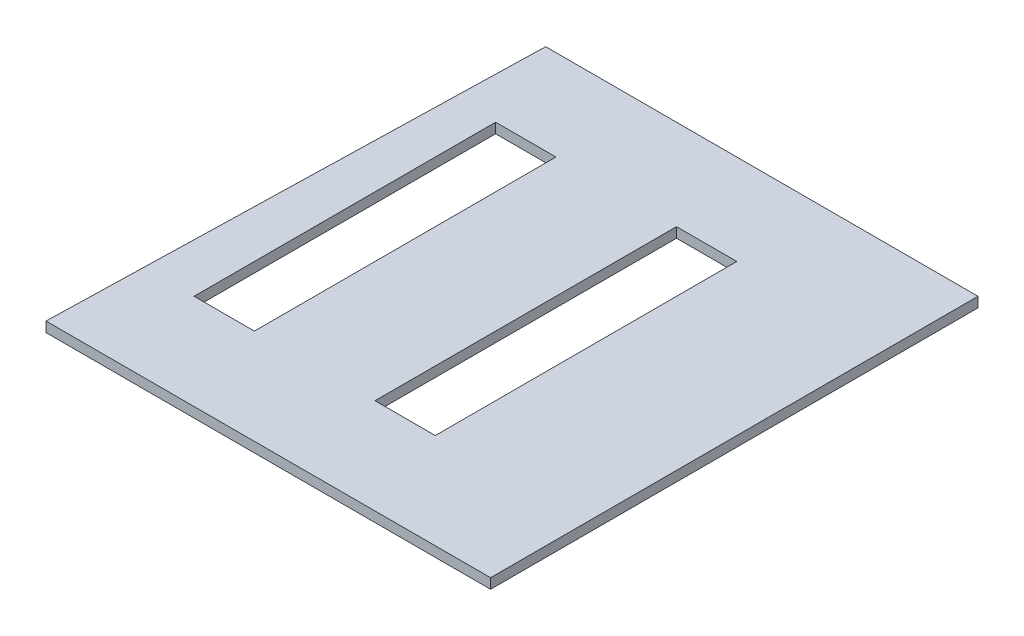
ISO-10303-21;
HEADER;
FILE_DESCRIPTION(('STEP AP214'),'2;1');
FILE_NAME('part.step','',(''),(''),'','','');
FILE_SCHEMA(('AUTOMOTIVE_DESIGN { 1 0 10303 214 1 1 1 1 }'));
ENDSEC;
DATA;
#1=APPLICATION_CONTEXT('core data for automotive mechanical design processes');
#2=APPLICATION_PROTOCOL_DEFINITION('international standard','automotive_design',2000,#1);
#3=PRODUCT_CONTEXT('',#1,'mechanical');
#4=PRODUCT('Part','Part','',(#3));
#5=PRODUCT_RELATED_PRODUCT_CATEGORY('part','',(#4));
#6=PRODUCT_DEFINITION_FORMATION('','',#4);
#7=PRODUCT_DEFINITION_CONTEXT('part definition',#1,'design');
#8=PRODUCT_DEFINITION('design','',#6,#7);
#9=PRODUCT_DEFINITION_SHAPE('','',#8);
#10=(LENGTH_UNIT() NAMED_UNIT(*) SI_UNIT(.MILLI.,.METRE.));
#11=(NAMED_UNIT(*) PLANE_ANGLE_UNIT() SI_UNIT($,.RADIAN.));
#12=(NAMED_UNIT(*) SI_UNIT($,.STERADIAN.) SOLID_ANGLE_UNIT());
#13=UNCERTAINTY_MEASURE_WITH_UNIT(LENGTH_MEASURE(1.E-05),#10,'distance_accuracy_value','');
#14=(GEOMETRIC_REPRESENTATION_CONTEXT(3) GLOBAL_UNCERTAINTY_ASSIGNED_CONTEXT((#13)) GLOBAL_UNIT_ASSIGNED_CONTEXT((#10,
#11,#12)) REPRESENTATION_CONTEXT('',''));
#15=CARTESIAN_POINT('',(0.,0.,0.));
#16=DIRECTION('',(0.,0.,1.));
#17=DIRECTION('',(1.,0.,0.));
#18=AXIS2_PLACEMENT_3D('',#15,#16,#17);
#19=CARTESIAN_POINT('',(1123.42457669165,50.8,-1231.7416518491));
#20=DIRECTION('',(-1.,0.,0.));
#21=DIRECTION('',(0.,0.,1.));
#22=AXIS2_PLACEMENT_3D('',#19,#20,#21);
#23=PLANE('',#22);
#24=DIRECTION('',(0.,0.,-1.));
#25=VECTOR('',#24,1.);
#26=CARTESIAN_POINT('',(1123.42457669165,0.,-1231.7416518491));
#27=LINE('',#26,#25);
#28=CARTESIAN_POINT('',(1123.42457669165,0.,1232.0583481509));
#29=VERTEX_POINT('',#28);
#30=CARTESIAN_POINT('',(1123.42457669165,0.,-1231.7416518491));
#31=VERTEX_POINT('',#30);
#32=EDGE_CURVE('E163',#29,#31,#27,.T.);
#33=ORIENTED_EDGE('',*,*,#32,.T.);
#34=DIRECTION('',(0.,-1.,0.));
#35=VECTOR('',#34,1.);
#36=CARTESIAN_POINT('',(1123.42457669165,50.8,-1231.7416518491));
#37=LINE('',#36,#35);
#38=CARTESIAN_POINT('',(1123.42457669165,50.8,-1231.7416518491));
#39=VERTEX_POINT('',#38);
#40=EDGE_CURVE('E11',#39,#31,#37,.T.);
#41=ORIENTED_EDGE('',*,*,#40,.F.);
#42=DIRECTION('',(0.,0.,-1.));
#43=VECTOR('',#42,1.);
#44=CARTESIAN_POINT('',(1123.42457669165,50.8,-1231.7416518491));
#45=LINE('',#44,#43);
#46=CARTESIAN_POINT('',(1123.42457669165,50.8,1232.0583481509));
#47=VERTEX_POINT('',#46);
#48=EDGE_CURVE('E192',#47,#39,#45,.T.);
#49=ORIENTED_EDGE('',*,*,#48,.F.);
#50=DIRECTION('',(0.,-1.,0.));
#51=VECTOR('',#50,1.);
#52=CARTESIAN_POINT('',(1123.42457669165,50.8,1232.0583481509));
#53=LINE('',#52,#51);
#54=EDGE_CURVE('E202',#47,#29,#53,.T.);
#55=ORIENTED_EDGE('',*,*,#54,.T.);
#56=EDGE_LOOP('',(#33,#41,#49,#55));
#57=FACE_BOUND('',#56,.T.);
#58=ADVANCED_FACE('F40',(#57),#23,.F.);
#59=CARTESIAN_POINT('',(-1061.73742330835,50.8,-1231.7416518491));
#60=DIRECTION('',(0.,0.,1.));
#61=DIRECTION('',(1.,0.,0.));
#62=AXIS2_PLACEMENT_3D('',#59,#60,#61);
#63=PLANE('',#62);
#64=DIRECTION('',(-1.,0.,0.));
#65=VECTOR('',#64,1.);
#66=CARTESIAN_POINT('',(-1061.73742330835,0.,-1231.7416518491));
#67=LINE('',#66,#65);
#68=CARTESIAN_POINT('',(-1061.73742330835,0.,-1231.7416518491));
#69=VERTEX_POINT('',#68);
#70=EDGE_CURVE('E205',#31,#69,#67,.T.);
#71=ORIENTED_EDGE('',*,*,#70,.T.);
#72=DIRECTION('',(0.,-1.,0.));
#73=VECTOR('',#72,1.);
#74=CARTESIAN_POINT('',(-1061.73742330835,50.8,-1231.7416518491));
#75=LINE('',#74,#73);
#76=CARTESIAN_POINT('',(-1061.73742330835,50.8,-1231.7416518491));
#77=VERTEX_POINT('',#76);
#78=EDGE_CURVE('E47',#77,#69,#75,.T.);
#79=ORIENTED_EDGE('',*,*,#78,.F.);
#80=DIRECTION('',(-1.,0.,0.));
#81=VECTOR('',#80,1.);
#82=CARTESIAN_POINT('',(-1061.73742330835,50.8,-1231.7416518491));
#83=LINE('',#82,#81);
#84=EDGE_CURVE('E195',#39,#77,#83,.T.);
#85=ORIENTED_EDGE('',*,*,#84,.F.);
#86=ORIENTED_EDGE('',*,*,#40,.T.);
#87=EDGE_LOOP('',(#71,#79,#85,#86));
#88=FACE_BOUND('',#87,.T.);
#89=ADVANCED_FACE('F234',(#88),#63,.F.);
#90=CARTESIAN_POINT('',(-1123.71342330835,50.8,1232.0583481509));
#91=DIRECTION('',(0.999683772127353,0.,0.0251466845772241));
#92=DIRECTION('',(0.0251466845772241,0.,-0.999683772127353));
#93=AXIS2_PLACEMENT_3D('',#90,#91,#92);
#94=PLANE('',#93);
#95=DIRECTION('',(-0.0251466845772241,0.,0.999683772127353));
#96=VECTOR('',#95,1.);
#97=CARTESIAN_POINT('',(-1123.71342330835,0.,1232.0583481509));
#98=LINE('',#97,#96);
#99=CARTESIAN_POINT('',(-1123.71342330835,0.,1232.0583481509));
#100=VERTEX_POINT('',#99);
#101=EDGE_CURVE('E207',#69,#100,#98,.T.);
#102=ORIENTED_EDGE('',*,*,#101,.T.);
#103=DIRECTION('',(0.,-1.,0.));
#104=VECTOR('',#103,1.);
#105=CARTESIAN_POINT('',(-1123.71342330835,50.8,1232.0583481509));
#106=LINE('',#105,#104);
#107=CARTESIAN_POINT('',(-1123.71342330835,50.8,1232.0583481509));
#108=VERTEX_POINT('',#107);
#109=EDGE_CURVE('E212',#108,#100,#106,.T.);
#110=ORIENTED_EDGE('',*,*,#109,.F.);
#111=DIRECTION('',(-0.0251466845772241,0.,0.999683772127353));
#112=VECTOR('',#111,1.);
#113=CARTESIAN_POINT('',(-1123.71342330835,50.8,1232.0583481509));
#114=LINE('',#113,#112);
#115=EDGE_CURVE('E198',#77,#108,#114,.T.);
#116=ORIENTED_EDGE('',*,*,#115,.F.);
#117=ORIENTED_EDGE('',*,*,#78,.T.);
#118=EDGE_LOOP('',(#102,#110,#116,#117));
#119=FACE_BOUND('',#118,.T.);
#120=ADVANCED_FACE('F219',(#119),#94,.F.);
#121=CARTESIAN_POINT('',(-1123.71342330835,50.8,1232.0583481509));
#122=DIRECTION('',(0.,0.,-1.));
#123=DIRECTION('',(-1.,0.,0.));
#124=AXIS2_PLACEMENT_3D('',#121,#122,#123);
#125=PLANE('',#124);
#126=DIRECTION('',(1.,0.,0.));
#127=VECTOR('',#126,1.);
#128=CARTESIAN_POINT('',(-1123.71342330835,0.,1232.0583481509));
#129=LINE('',#128,#127);
#130=EDGE_CURVE('E196',#100,#29,#129,.T.);
#131=ORIENTED_EDGE('',*,*,#130,.T.);
#132=ORIENTED_EDGE('',*,*,#54,.F.);
#133=DIRECTION('',(1.,0.,0.));
#134=VECTOR('',#133,1.);
#135=CARTESIAN_POINT('',(-1123.71342330835,50.8,1232.0583481509));
#136=LINE('',#135,#134);
#137=EDGE_CURVE('E200',#108,#47,#136,.T.);
#138=ORIENTED_EDGE('',*,*,#137,.F.);
#139=ORIENTED_EDGE('',*,*,#109,.T.);
#140=EDGE_LOOP('',(#131,#132,#138,#139));
#141=FACE_BOUND('',#140,.T.);
#142=ADVANCED_FACE('F228',(#141),#125,.F.);
#143=CARTESIAN_POINT('',(0.,50.8,0.));
#144=DIRECTION('',(0.,1.,0.));
#145=DIRECTION('',(0.,0.,1.));
#146=AXIS2_PLACEMENT_3D('',#143,#144,#145);
#147=PLANE('',#146);
#148=DIRECTION('',(0.,0.,-1.));
#149=VECTOR('',#148,1.);
#150=CARTESIAN_POINT('',(361.424576691651,50.8,749.458348150897));
#151=LINE('',#150,#149);
#152=CARTESIAN_POINT('',(361.424576691651,50.8,749.458348150897));
#153=VERTEX_POINT('',#152);
#154=CARTESIAN_POINT('',(361.424576691651,50.8,-774.541651849103));
#155=VERTEX_POINT('',#154);
#156=EDGE_CURVE('E54',#153,#155,#151,.T.);
#157=ORIENTED_EDGE('',*,*,#156,.F.);
#158=DIRECTION('',(1.,0.,0.));
#159=VECTOR('',#158,1.);
#160=CARTESIAN_POINT('',(56.6245766916513,50.8,749.458348150897));
#161=LINE('',#160,#159);
#162=CARTESIAN_POINT('',(56.6245766916513,50.8,749.458348150897));
#163=VERTEX_POINT('',#162);
#164=EDGE_CURVE('E152',#163,#153,#161,.T.);
#165=ORIENTED_EDGE('',*,*,#164,.F.);
#166=DIRECTION('',(0.,0.,1.));
#167=VECTOR('',#166,1.);
#168=CARTESIAN_POINT('',(56.6245766916513,50.8,749.458348150897));
#169=LINE('',#168,#167);
#170=CARTESIAN_POINT('',(56.6245766916513,50.8,-774.541651849103));
#171=VERTEX_POINT('',#170);
#172=EDGE_CURVE('E135',#171,#163,#169,.T.);
#173=ORIENTED_EDGE('',*,*,#172,.F.);
#174=DIRECTION('',(-1.,0.,0.));
#175=VECTOR('',#174,1.);
#176=CARTESIAN_POINT('',(56.6245766916513,50.8,-774.541651849103));
#177=LINE('',#176,#175);
#178=EDGE_CURVE('E145',#155,#171,#177,.T.);
#179=ORIENTED_EDGE('',*,*,#178,.F.);
#180=EDGE_LOOP('',(#157,#165,#173,#179));
#181=FACE_BOUND('',#180,.T.);
#182=DIRECTION('',(0.,0.,-1.));
#183=VECTOR('',#182,1.);
#184=CARTESIAN_POINT('',(-552.975423308349,50.8,749.458348150897));
#185=LINE('',#184,#183);
#186=CARTESIAN_POINT('',(-552.975423308349,50.8,749.458348150897));
#187=VERTEX_POINT('',#186);
#188=CARTESIAN_POINT('',(-552.975423308349,50.8,-774.541651849103));
#189=VERTEX_POINT('',#188);
#190=EDGE_CURVE('E62',#187,#189,#185,.T.);
#191=ORIENTED_EDGE('',*,*,#190,.F.);
#192=DIRECTION('',(1.,0.,0.));
#193=VECTOR('',#192,1.);
#194=CARTESIAN_POINT('',(-857.775423308349,50.8,749.458348150897));
#195=LINE('',#194,#193);
#196=CARTESIAN_POINT('',(-857.775423308349,50.8,749.458348150897));
#197=VERTEX_POINT('',#196);
#198=EDGE_CURVE('E181',#197,#187,#195,.T.);
#199=ORIENTED_EDGE('',*,*,#198,.F.);
#200=DIRECTION('',(0.,0.,1.));
#201=VECTOR('',#200,1.);
#202=CARTESIAN_POINT('',(-857.775423308349,50.8,749.458348150897));
#203=LINE('',#202,#201);
#204=CARTESIAN_POINT('',(-857.775423308349,50.8,-774.541651849103));
#205=VERTEX_POINT('',#204);
#206=EDGE_CURVE('E178',#205,#197,#203,.T.);
#207=ORIENTED_EDGE('',*,*,#206,.F.);
#208=DIRECTION('',(-1.,0.,0.));
#209=VECTOR('',#208,1.);
#210=CARTESIAN_POINT('',(-857.775423308349,50.8,-774.541651849103));
#211=LINE('',#210,#209);
#212=EDGE_CURVE('E175',#189,#205,#211,.T.);
#213=ORIENTED_EDGE('',*,*,#212,.F.);
#214=EDGE_LOOP('',(#191,#199,#207,#213));
#215=FACE_BOUND('',#214,.T.);
#216=ORIENTED_EDGE('',*,*,#48,.T.);
#217=ORIENTED_EDGE('',*,*,#84,.T.);
#218=ORIENTED_EDGE('',*,*,#115,.T.);
#219=ORIENTED_EDGE('',*,*,#137,.T.);
#220=EDGE_LOOP('',(#216,#217,#218,#219));
#221=FACE_BOUND('',#220,.T.);
#222=ADVANCED_FACE('F149',(#181,#215,#221),#147,.T.);
#223=CARTESIAN_POINT('',(0.,0.,0.));
#224=DIRECTION('',(0.,1.,0.));
#225=DIRECTION('',(0.,0.,1.));
#226=AXIS2_PLACEMENT_3D('',#223,#224,#225);
#227=PLANE('',#226);
#228=DIRECTION('',(-1.,0.,0.));
#229=VECTOR('',#228,1.);
#230=CARTESIAN_POINT('',(56.6245766916513,0.,749.458348150897));
#231=LINE('',#230,#229);
#232=CARTESIAN_POINT('',(361.424576691651,0.,749.458348150897));
#233=VERTEX_POINT('',#232);
#234=CARTESIAN_POINT('',(56.6245766916513,0.,749.458348150897));
#235=VERTEX_POINT('',#234);
#236=EDGE_CURVE('E278',#233,#235,#231,.T.);
#237=ORIENTED_EDGE('',*,*,#236,.F.);
#238=DIRECTION('',(0.,0.,1.));
#239=VECTOR('',#238,1.);
#240=CARTESIAN_POINT('',(361.424576691651,0.,749.458348150897));
#241=LINE('',#240,#239);
#242=CARTESIAN_POINT('',(361.424576691651,0.,-774.541651849103));
#243=VERTEX_POINT('',#242);
#244=EDGE_CURVE('E164',#243,#233,#241,.T.);
#245=ORIENTED_EDGE('',*,*,#244,.F.);
#246=DIRECTION('',(1.,0.,0.));
#247=VECTOR('',#246,1.);
#248=CARTESIAN_POINT('',(56.6245766916513,0.,-774.541651849103));
#249=LINE('',#248,#247);
#250=CARTESIAN_POINT('',(56.6245766916513,0.,-774.541651849103));
#251=VERTEX_POINT('',#250);
#252=EDGE_CURVE('E161',#251,#243,#249,.T.);
#253=ORIENTED_EDGE('',*,*,#252,.F.);
#254=DIRECTION('',(0.,0.,-1.));
#255=VECTOR('',#254,1.);
#256=CARTESIAN_POINT('',(56.6245766916513,0.,749.458348150897));
#257=LINE('',#256,#255);
#258=EDGE_CURVE('E138',#235,#251,#257,.T.);
#259=ORIENTED_EDGE('',*,*,#258,.F.);
#260=EDGE_LOOP('',(#237,#245,#253,#259));
#261=FACE_BOUND('',#260,.T.);
#262=DIRECTION('',(-1.,0.,0.));
#263=VECTOR('',#262,1.);
#264=CARTESIAN_POINT('',(-857.775423308349,0.,749.458348150897));
#265=LINE('',#264,#263);
#266=CARTESIAN_POINT('',(-552.975423308349,0.,749.458348150897));
#267=VERTEX_POINT('',#266);
#268=CARTESIAN_POINT('',(-857.775423308349,0.,749.458348150897));
#269=VERTEX_POINT('',#268);
#270=EDGE_CURVE('E168',#267,#269,#265,.T.);
#271=ORIENTED_EDGE('',*,*,#270,.F.);
#272=DIRECTION('',(0.,0.,1.));
#273=VECTOR('',#272,1.);
#274=CARTESIAN_POINT('',(-552.975423308349,0.,749.458348150897));
#275=LINE('',#274,#273);
#276=CARTESIAN_POINT('',(-552.975423308349,0.,-774.541651849103));
#277=VERTEX_POINT('',#276);
#278=EDGE_CURVE('E171',#277,#267,#275,.T.);
#279=ORIENTED_EDGE('',*,*,#278,.F.);
#280=DIRECTION('',(1.,0.,0.));
#281=VECTOR('',#280,1.);
#282=CARTESIAN_POINT('',(-857.775423308349,0.,-774.541651849103));
#283=LINE('',#282,#281);
#284=CARTESIAN_POINT('',(-857.775423308349,0.,-774.541651849103));
#285=VERTEX_POINT('',#284);
#286=EDGE_CURVE('E173',#285,#277,#283,.T.);
#287=ORIENTED_EDGE('',*,*,#286,.F.);
#288=DIRECTION('',(0.,0.,-1.));
#289=VECTOR('',#288,1.);
#290=CARTESIAN_POINT('',(-857.775423308349,0.,749.458348150897));
#291=LINE('',#290,#289);
#292=EDGE_CURVE('E165',#269,#285,#291,.T.);
#293=ORIENTED_EDGE('',*,*,#292,.F.);
#294=EDGE_LOOP('',(#271,#279,#287,#293));
#295=FACE_BOUND('',#294,.T.);
#296=ORIENTED_EDGE('',*,*,#32,.F.);
#297=ORIENTED_EDGE('',*,*,#130,.F.);
#298=ORIENTED_EDGE('',*,*,#101,.F.);
#299=ORIENTED_EDGE('',*,*,#70,.F.);
#300=EDGE_LOOP('',(#296,#297,#298,#299));
#301=FACE_BOUND('',#300,.T.);
#302=ADVANCED_FACE('F225',(#261,#295,#301),#227,.F.);
#303=CARTESIAN_POINT('',(-552.975423308349,-1554.18114774308,749.458348150897));
#304=DIRECTION('',(1.,0.,0.));
#305=DIRECTION('',(0.,0.,-1.));
#306=AXIS2_PLACEMENT_3D('',#303,#304,#305);
#307=PLANE('',#306);
#308=ORIENTED_EDGE('',*,*,#278,.T.);
#309=DIRECTION('',(0.,1.,0.));
#310=VECTOR('',#309,1.);
#311=CARTESIAN_POINT('',(-552.975423308349,-1554.18114774308,749.458348150897));
#312=LINE('',#311,#310);
#313=EDGE_CURVE('E169',#267,#187,#312,.T.);
#314=ORIENTED_EDGE('',*,*,#313,.T.);
#315=ORIENTED_EDGE('',*,*,#190,.T.);
#316=DIRECTION('',(0.,1.,0.));
#317=VECTOR('',#316,1.);
#318=CARTESIAN_POINT('',(-552.975423308349,-1554.18114774308,-774.541651849103));
#319=LINE('',#318,#317);
#320=EDGE_CURVE('E184',#277,#189,#319,.T.);
#321=ORIENTED_EDGE('',*,*,#320,.F.);
#322=EDGE_LOOP('',(#308,#314,#315,#321));
#323=FACE_BOUND('',#322,.T.);
#324=ADVANCED_FACE('F246',(#323),#307,.F.);
#325=CARTESIAN_POINT('',(-857.775423308349,-1554.18114774308,749.458348150897));
#326=DIRECTION('',(0.,0.,1.));
#327=DIRECTION('',(1.,0.,0.));
#328=AXIS2_PLACEMENT_3D('',#325,#326,#327);
#329=PLANE('',#328);
#330=ORIENTED_EDGE('',*,*,#270,.T.);
#331=DIRECTION('',(0.,1.,0.));
#332=VECTOR('',#331,1.);
#333=CARTESIAN_POINT('',(-857.775423308349,-1554.18114774308,749.458348150897));
#334=LINE('',#333,#332);
#335=EDGE_CURVE('E186',#269,#197,#334,.T.);
#336=ORIENTED_EDGE('',*,*,#335,.T.);
#337=ORIENTED_EDGE('',*,*,#198,.T.);
#338=ORIENTED_EDGE('',*,*,#313,.F.);
#339=EDGE_LOOP('',(#330,#336,#337,#338));
#340=FACE_BOUND('',#339,.T.);
#341=ADVANCED_FACE('F252',(#340),#329,.F.);
#342=CARTESIAN_POINT('',(-857.775423308349,-1554.18114774308,749.458348150897));
#343=DIRECTION('',(-1.,0.,0.));
#344=DIRECTION('',(0.,0.,1.));
#345=AXIS2_PLACEMENT_3D('',#342,#343,#344);
#346=PLANE('',#345);
#347=ORIENTED_EDGE('',*,*,#292,.T.);
#348=DIRECTION('',(0.,1.,0.));
#349=VECTOR('',#348,1.);
#350=CARTESIAN_POINT('',(-857.775423308349,-1554.18114774308,-774.541651849103));
#351=LINE('',#350,#349);
#352=EDGE_CURVE('E188',#285,#205,#351,.T.);
#353=ORIENTED_EDGE('',*,*,#352,.T.);
#354=ORIENTED_EDGE('',*,*,#206,.T.);
#355=ORIENTED_EDGE('',*,*,#335,.F.);
#356=EDGE_LOOP('',(#347,#353,#354,#355));
#357=FACE_BOUND('',#356,.T.);
#358=ADVANCED_FACE('F257',(#357),#346,.F.);
#359=CARTESIAN_POINT('',(-857.775423308349,-1554.18114774308,-774.541651849103));
#360=DIRECTION('',(0.,0.,-1.));
#361=DIRECTION('',(-1.,0.,0.));
#362=AXIS2_PLACEMENT_3D('',#359,#360,#361);
#363=PLANE('',#362);
#364=ORIENTED_EDGE('',*,*,#286,.T.);
#365=ORIENTED_EDGE('',*,*,#320,.T.);
#366=ORIENTED_EDGE('',*,*,#212,.T.);
#367=ORIENTED_EDGE('',*,*,#352,.F.);
#368=EDGE_LOOP('',(#364,#365,#366,#367));
#369=FACE_BOUND('',#368,.T.);
#370=ADVANCED_FACE('F253',(#369),#363,.F.);
#371=CARTESIAN_POINT('',(361.424576691651,-1554.18114774308,749.458348150897));
#372=DIRECTION('',(1.,0.,0.));
#373=DIRECTION('',(0.,0.,-1.));
#374=AXIS2_PLACEMENT_3D('',#371,#372,#373);
#375=PLANE('',#374);
#376=ORIENTED_EDGE('',*,*,#244,.T.);
#377=DIRECTION('',(0.,1.,0.));
#378=VECTOR('',#377,1.);
#379=CARTESIAN_POINT('',(361.424576691651,-1554.18114774308,749.458348150897));
#380=LINE('',#379,#378);
#381=EDGE_CURVE('E157',#233,#153,#380,.T.);
#382=ORIENTED_EDGE('',*,*,#381,.T.);
#383=ORIENTED_EDGE('',*,*,#156,.T.);
#384=DIRECTION('',(0.,1.,0.));
#385=VECTOR('',#384,1.);
#386=CARTESIAN_POINT('',(361.424576691651,-1554.18114774308,-774.541651849103));
#387=LINE('',#386,#385);
#388=EDGE_CURVE('E142',#243,#155,#387,.T.);
#389=ORIENTED_EDGE('',*,*,#388,.F.);
#390=EDGE_LOOP('',(#376,#382,#383,#389));
#391=FACE_BOUND('',#390,.T.);
#392=ADVANCED_FACE('F256',(#391),#375,.F.);
#393=CARTESIAN_POINT('',(56.6245766916513,-1554.18114774308,749.458348150897));
#394=DIRECTION('',(0.,0.,1.));
#395=DIRECTION('',(1.,0.,0.));
#396=AXIS2_PLACEMENT_3D('',#393,#394,#395);
#397=PLANE('',#396);
#398=ORIENTED_EDGE('',*,*,#236,.T.);
#399=DIRECTION('',(0.,1.,0.));
#400=VECTOR('',#399,1.);
#401=CARTESIAN_POINT('',(56.6245766916513,-1554.18114774308,749.458348150897));
#402=LINE('',#401,#400);
#403=EDGE_CURVE('E141',#235,#163,#402,.T.);
#404=ORIENTED_EDGE('',*,*,#403,.T.);
#405=ORIENTED_EDGE('',*,*,#164,.T.);
#406=ORIENTED_EDGE('',*,*,#381,.F.);
#407=EDGE_LOOP('',(#398,#404,#405,#406));
#408=FACE_BOUND('',#407,.T.);
#409=ADVANCED_FACE('F267',(#408),#397,.F.);
#410=CARTESIAN_POINT('',(56.6245766916513,-1554.18114774308,749.458348150897));
#411=DIRECTION('',(-1.,0.,0.));
#412=DIRECTION('',(0.,0.,1.));
#413=AXIS2_PLACEMENT_3D('',#410,#411,#412);
#414=PLANE('',#413);
#415=ORIENTED_EDGE('',*,*,#258,.T.);
#416=DIRECTION('',(0.,1.,0.));
#417=VECTOR('',#416,1.);
#418=CARTESIAN_POINT('',(56.6245766916513,-1554.18114774308,-774.541651849103));
#419=LINE('',#418,#417);
#420=EDGE_CURVE('E130',#251,#171,#419,.T.);
#421=ORIENTED_EDGE('',*,*,#420,.T.);
#422=ORIENTED_EDGE('',*,*,#172,.T.);
#423=ORIENTED_EDGE('',*,*,#403,.F.);
#424=EDGE_LOOP('',(#415,#421,#422,#423));
#425=FACE_BOUND('',#424,.T.);
#426=ADVANCED_FACE('F132',(#425),#414,.F.);
#427=CARTESIAN_POINT('',(56.6245766916513,-1554.18114774308,-774.541651849103));
#428=DIRECTION('',(0.,0.,-1.));
#429=DIRECTION('',(-1.,0.,0.));
#430=AXIS2_PLACEMENT_3D('',#427,#428,#429);
#431=PLANE('',#430);
#432=ORIENTED_EDGE('',*,*,#252,.T.);
#433=ORIENTED_EDGE('',*,*,#388,.T.);
#434=ORIENTED_EDGE('',*,*,#178,.T.);
#435=ORIENTED_EDGE('',*,*,#420,.F.);
#436=EDGE_LOOP('',(#432,#433,#434,#435));
#437=FACE_BOUND('',#436,.T.);
#438=ADVANCED_FACE('F146',(#437),#431,.F.);
#439=CLOSED_SHELL('',(#58,#89,#120,#142,#222,#302,#324,#341,#358,#370,#392,#409,#426,#438));
#440=MANIFOLD_SOLID_BREP('B2',#439);
#441=ADVANCED_BREP_SHAPE_REPRESENTATION('',(#18,#440),#14);
#442=SHAPE_DEFINITION_REPRESENTATION(#9,#441);
ENDSEC;
END-ISO-10303-21;
